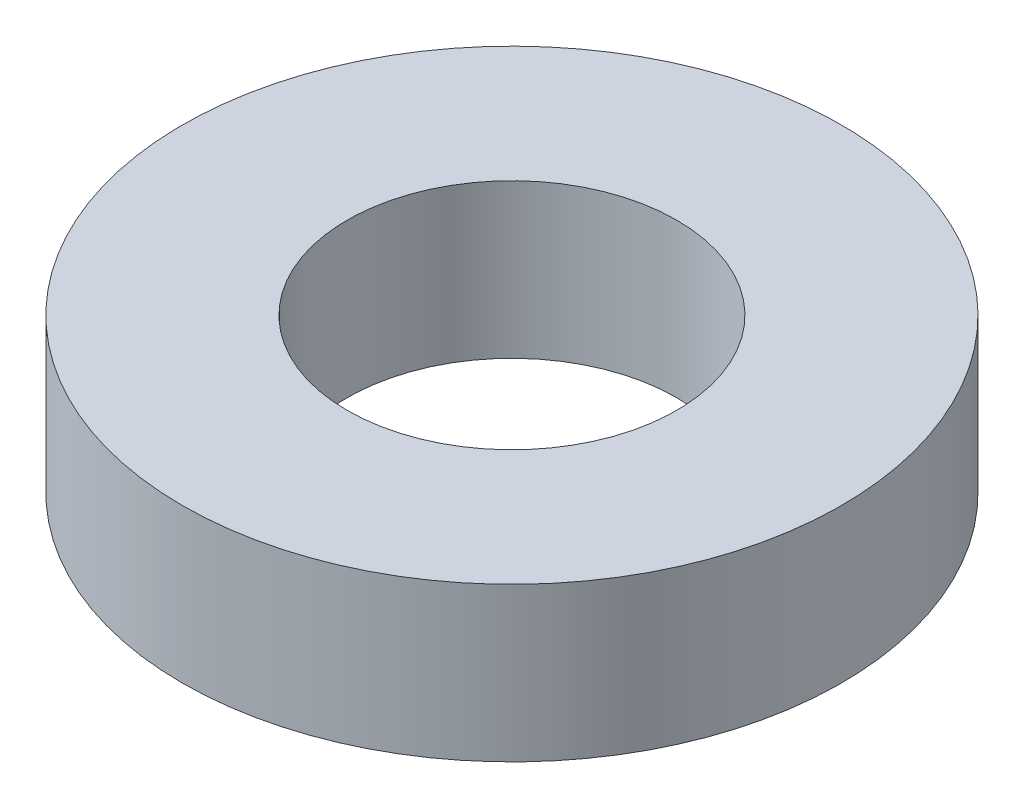
ISO-10303-21;
HEADER;
FILE_DESCRIPTION(('STEP AP214'),'2;1');
FILE_NAME('part.step','',(''),(''),'','','');
FILE_SCHEMA(('AUTOMOTIVE_DESIGN { 1 0 10303 214 1 1 1 1 }'));
ENDSEC;
DATA;
#1=APPLICATION_CONTEXT('core data for automotive mechanical design processes');
#2=APPLICATION_PROTOCOL_DEFINITION('international standard','automotive_design',2000,#1);
#3=PRODUCT_CONTEXT('',#1,'mechanical');
#4=PRODUCT('Part','Part','',(#3));
#5=PRODUCT_RELATED_PRODUCT_CATEGORY('part','',(#4));
#6=PRODUCT_DEFINITION_FORMATION('','',#4);
#7=PRODUCT_DEFINITION_CONTEXT('part definition',#1,'design');
#8=PRODUCT_DEFINITION('design','',#6,#7);
#9=PRODUCT_DEFINITION_SHAPE('','',#8);
#10=(LENGTH_UNIT() NAMED_UNIT(*) SI_UNIT(.MILLI.,.METRE.));
#11=(NAMED_UNIT(*) PLANE_ANGLE_UNIT() SI_UNIT($,.RADIAN.));
#12=(NAMED_UNIT(*) SI_UNIT($,.STERADIAN.) SOLID_ANGLE_UNIT());
#13=UNCERTAINTY_MEASURE_WITH_UNIT(LENGTH_MEASURE(1.E-05),#10,'distance_accuracy_value','');
#14=(GEOMETRIC_REPRESENTATION_CONTEXT(3) GLOBAL_UNCERTAINTY_ASSIGNED_CONTEXT((#13)) GLOBAL_UNIT_ASSIGNED_CONTEXT((#10,
#11,#12)) REPRESENTATION_CONTEXT('',''));
#15=CARTESIAN_POINT('',(0.,0.,0.));
#16=DIRECTION('',(0.,0.,1.));
#17=DIRECTION('',(1.,0.,0.));
#18=AXIS2_PLACEMENT_3D('',#15,#16,#17);
#19=CARTESIAN_POINT('',(0.,14.,0.));
#20=DIRECTION('',(0.,-1.,0.));
#21=DIRECTION('',(0.,0.,-1.));
#22=AXIS2_PLACEMENT_3D('',#19,#20,#21);
#23=CYLINDRICAL_SURFACE('',#22,30.);
#24=CARTESIAN_POINT('',(0.,14.,0.));
#25=DIRECTION('',(0.,1.,0.));
#26=DIRECTION('',(0.,0.,1.));
#27=AXIS2_PLACEMENT_3D('',#24,#25,#26);
#28=CIRCLE('',#27,30.);
#29=CARTESIAN_POINT('',(0.,14.,30.));
#30=VERTEX_POINT('',#29);
#31=EDGE_CURVE('E10',#30,#30,#28,.T.);
#32=ORIENTED_EDGE('',*,*,#31,.F.);
#33=EDGE_LOOP('',(#32));
#34=FACE_BOUND('',#33,.T.);
#35=CARTESIAN_POINT('',(0.,0.,0.));
#36=DIRECTION('',(0.,1.,0.));
#37=DIRECTION('',(0.,0.,1.));
#38=AXIS2_PLACEMENT_3D('',#35,#36,#37);
#39=CIRCLE('',#38,30.);
#40=CARTESIAN_POINT('',(0.,0.,30.));
#41=VERTEX_POINT('',#40);
#42=EDGE_CURVE('E37',#41,#41,#39,.T.);
#43=ORIENTED_EDGE('',*,*,#42,.T.);
#44=EDGE_LOOP('',(#43));
#45=FACE_BOUND('',#44,.T.);
#46=ADVANCED_FACE('F40',(#34,#45),#23,.T.);
#47=CARTESIAN_POINT('',(0.,14.,0.));
#48=DIRECTION('',(0.,1.,0.));
#49=DIRECTION('',(0.,0.,1.));
#50=AXIS2_PLACEMENT_3D('',#47,#48,#49);
#51=PLANE('',#50);
#52=CARTESIAN_POINT('',(0.,14.,0.));
#53=DIRECTION('',(0.,1.,0.));
#54=DIRECTION('',(0.,0.,1.));
#55=AXIS2_PLACEMENT_3D('',#52,#53,#54);
#56=CIRCLE('',#55,15.);
#57=CARTESIAN_POINT('',(0.,14.,15.));
#58=VERTEX_POINT('',#57);
#59=EDGE_CURVE('E50',#58,#58,#56,.T.);
#60=ORIENTED_EDGE('',*,*,#59,.F.);
#61=EDGE_LOOP('',(#60));
#62=FACE_BOUND('',#61,.T.);
#63=ORIENTED_EDGE('',*,*,#31,.T.);
#64=EDGE_LOOP('',(#63));
#65=FACE_BOUND('',#64,.T.);
#66=ADVANCED_FACE('F59',(#62,#65),#51,.T.);
#67=CARTESIAN_POINT('',(0.,0.,0.));
#68=DIRECTION('',(0.,1.,0.));
#69=DIRECTION('',(0.,0.,1.));
#70=AXIS2_PLACEMENT_3D('',#67,#68,#69);
#71=PLANE('',#70);
#72=CARTESIAN_POINT('',(0.,0.,0.));
#73=DIRECTION('',(0.,1.,0.));
#74=DIRECTION('',(0.,0.,1.));
#75=AXIS2_PLACEMENT_3D('',#72,#73,#74);
#76=CIRCLE('',#75,15.);
#77=CARTESIAN_POINT('',(0.,0.,15.));
#78=VERTEX_POINT('',#77);
#79=EDGE_CURVE('E47',#78,#78,#76,.T.);
#80=ORIENTED_EDGE('',*,*,#79,.T.);
#81=EDGE_LOOP('',(#80));
#82=FACE_BOUND('',#81,.T.);
#83=ORIENTED_EDGE('',*,*,#42,.F.);
#84=EDGE_LOOP('',(#83));
#85=FACE_BOUND('',#84,.T.);
#86=ADVANCED_FACE('F58',(#82,#85),#71,.F.);
#87=CARTESIAN_POINT('',(0.,14.,0.));
#88=DIRECTION('',(0.,-1.,0.));
#89=DIRECTION('',(0.,0.,-1.));
#90=AXIS2_PLACEMENT_3D('',#87,#88,#89);
#91=CYLINDRICAL_SURFACE('',#90,15.);
#92=ORIENTED_EDGE('',*,*,#59,.T.);
#93=EDGE_LOOP('',(#92));
#94=FACE_BOUND('',#93,.T.);
#95=ORIENTED_EDGE('',*,*,#79,.F.);
#96=EDGE_LOOP('',(#95));
#97=FACE_BOUND('',#96,.T.);
#98=ADVANCED_FACE('F54',(#94,#97),#91,.F.);
#99=CLOSED_SHELL('',(#46,#66,#86,#98));
#100=MANIFOLD_SOLID_BREP('B2',#99);
#101=ADVANCED_BREP_SHAPE_REPRESENTATION('',(#18,#100),#14);
#102=SHAPE_DEFINITION_REPRESENTATION(#9,#101);
ENDSEC;
END-ISO-10303-21;
